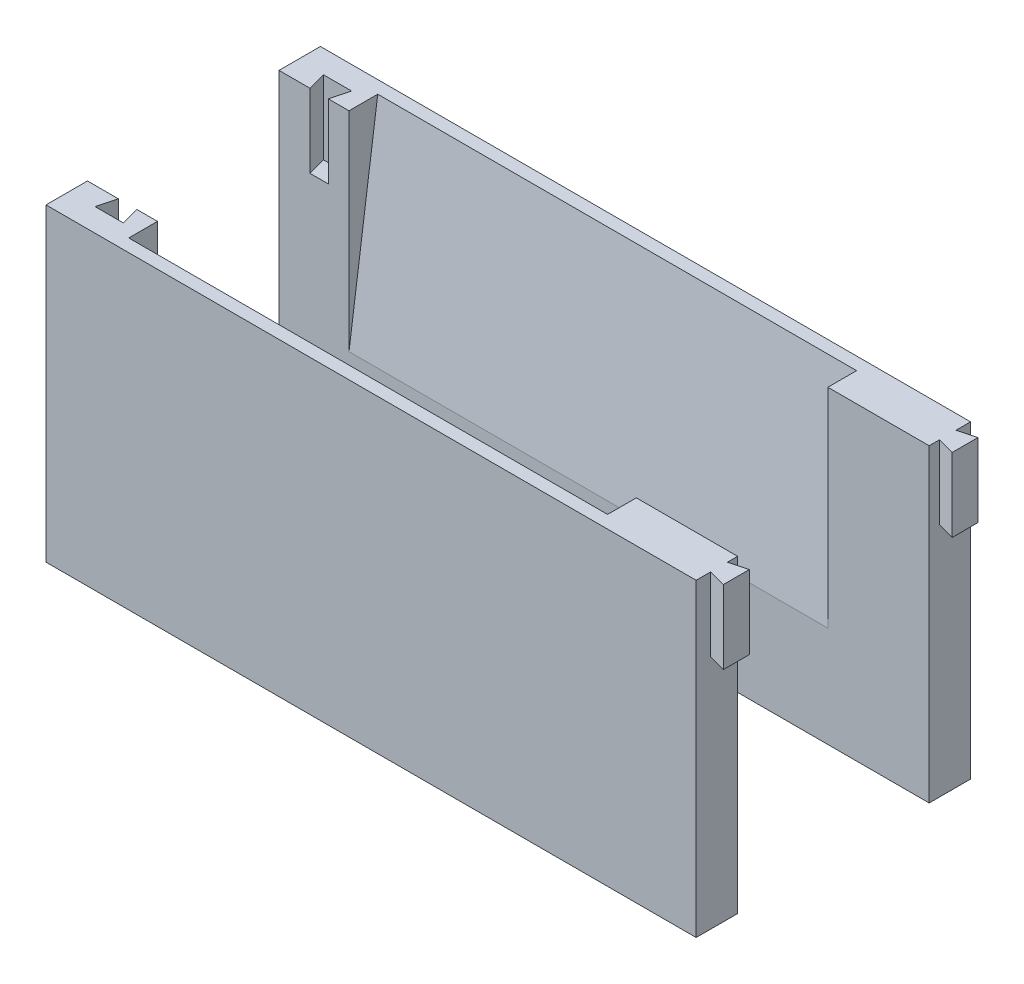
ISO-10303-21;
HEADER;
FILE_DESCRIPTION(('STEP AP214'),'2;1');
FILE_NAME('part.step','',(''),(''),'','','');
FILE_SCHEMA(('AUTOMOTIVE_DESIGN { 1 0 10303 214 1 1 1 1 }'));
ENDSEC;
DATA;
#1=APPLICATION_CONTEXT('core data for automotive mechanical design processes');
#2=APPLICATION_PROTOCOL_DEFINITION('international standard','automotive_design',2000,#1);
#3=PRODUCT_CONTEXT('',#1,'mechanical');
#4=PRODUCT('Part','Part','',(#3));
#5=PRODUCT_RELATED_PRODUCT_CATEGORY('part','',(#4));
#6=PRODUCT_DEFINITION_FORMATION('','',#4);
#7=PRODUCT_DEFINITION_CONTEXT('part definition',#1,'design');
#8=PRODUCT_DEFINITION('design','',#6,#7);
#9=PRODUCT_DEFINITION_SHAPE('','',#8);
#10=(LENGTH_UNIT() NAMED_UNIT(*) SI_UNIT(.MILLI.,.METRE.));
#11=(NAMED_UNIT(*) PLANE_ANGLE_UNIT() SI_UNIT($,.RADIAN.));
#12=(NAMED_UNIT(*) SI_UNIT($,.STERADIAN.) SOLID_ANGLE_UNIT());
#13=UNCERTAINTY_MEASURE_WITH_UNIT(LENGTH_MEASURE(1.E-05),#10,'distance_accuracy_value','');
#14=(GEOMETRIC_REPRESENTATION_CONTEXT(3) GLOBAL_UNCERTAINTY_ASSIGNED_CONTEXT((#13)) GLOBAL_UNIT_ASSIGNED_CONTEXT((#10,
#11,#12)) REPRESENTATION_CONTEXT('',''));
#15=CARTESIAN_POINT('',(0.,0.,0.));
#16=DIRECTION('',(0.,0.,1.));
#17=DIRECTION('',(1.,0.,0.));
#18=AXIS2_PLACEMENT_3D('',#15,#16,#17);
#19=CARTESIAN_POINT('',(46.2989745050857,14.0482922625164,-31.));
#20=DIRECTION('',(-1.,0.,0.));
#21=DIRECTION('',(0.,0.,-1.));
#22=AXIS2_PLACEMENT_3D('',#19,#20,#21);
#23=PLANE('',#22);
#24=DIRECTION('',(0.,1.,0.));
#25=VECTOR('',#24,1.);
#26=CARTESIAN_POINT('',(46.2989745050857,4.04829226251643,-27.4));
#27=LINE('',#26,#25);
#28=CARTESIAN_POINT('',(46.2989745050857,4.04829226251643,-27.4));
#29=VERTEX_POINT('',#28);
#30=CARTESIAN_POINT('',(46.2989745050857,14.0482922625164,-27.4));
#31=VERTEX_POINT('',#30);
#32=EDGE_CURVE('E225',#29,#31,#27,.T.);
#33=ORIENTED_EDGE('',*,*,#32,.T.);
#34=DIRECTION('',(0.,0.,1.));
#35=VECTOR('',#34,1.);
#36=CARTESIAN_POINT('',(46.2989745050857,14.0482922625164,-31.));
#37=LINE('',#36,#35);
#38=CARTESIAN_POINT('',(46.2989745050857,14.0482922625164,-26.));
#39=VERTEX_POINT('',#38);
#40=EDGE_CURVE('E170',#31,#39,#37,.T.);
#41=ORIENTED_EDGE('',*,*,#40,.T.);
#42=DIRECTION('',(0.,1.,0.));
#43=VECTOR('',#42,1.);
#44=CARTESIAN_POINT('',(46.2989745050857,14.0482922625164,-26.));
#45=LINE('',#44,#43);
#46=CARTESIAN_POINT('',(46.2989745050857,-27.9517077374836,-26.));
#47=VERTEX_POINT('',#46);
#48=EDGE_CURVE('E267',#47,#39,#45,.T.);
#49=ORIENTED_EDGE('',*,*,#48,.F.);
#50=DIRECTION('',(0.,0.,1.));
#51=VECTOR('',#50,1.);
#52=CARTESIAN_POINT('',(46.2989745050857,-27.9517077374836,-31.));
#53=LINE('',#52,#51);
#54=CARTESIAN_POINT('',(46.2989745050857,-27.9517077374836,-31.6203193977869));
#55=VERTEX_POINT('',#54);
#56=EDGE_CURVE('E61',#55,#47,#53,.T.);
#57=ORIENTED_EDGE('',*,*,#56,.F.);
#58=DIRECTION('',(0.,1.,0.));
#59=VECTOR('',#58,1.);
#60=CARTESIAN_POINT('',(46.2989745050857,-27.9517077374836,-31.6203193977869));
#61=LINE('',#60,#59);
#62=CARTESIAN_POINT('',(46.2989745050857,14.0482922625164,-31.6203193977869));
#63=VERTEX_POINT('',#62);
#64=EDGE_CURVE('E180',#55,#63,#61,.T.);
#65=ORIENTED_EDGE('',*,*,#64,.T.);
#66=CARTESIAN_POINT('',(46.2989745050857,14.0482922625164,-29.65));
#67=VERTEX_POINT('',#66);
#68=EDGE_CURVE('E184',#63,#67,#37,.T.);
#69=ORIENTED_EDGE('',*,*,#68,.T.);
#70=DIRECTION('',(0.,1.,0.));
#71=VECTOR('',#70,1.);
#72=CARTESIAN_POINT('',(46.2989745050857,4.04829226251643,-29.65));
#73=LINE('',#72,#71);
#74=CARTESIAN_POINT('',(46.2989745050857,4.04829226251643,-29.65));
#75=VERTEX_POINT('',#74);
#76=EDGE_CURVE('E219',#75,#67,#73,.T.);
#77=ORIENTED_EDGE('',*,*,#76,.F.);
#78=DIRECTION('',(0.,0.,-1.));
#79=VECTOR('',#78,1.);
#80=CARTESIAN_POINT('',(46.2989745050857,4.04829226251643,-27.4));
#81=LINE('',#80,#79);
#82=EDGE_CURVE('E209',#29,#75,#81,.T.);
#83=ORIENTED_EDGE('',*,*,#82,.F.);
#84=EDGE_LOOP('',(#33,#41,#49,#57,#65,#69,#77,#83));
#85=FACE_BOUND('',#84,.T.);
#86=ADVANCED_FACE('F53',(#85),#23,.F.);
#87=CARTESIAN_POINT('',(0.,0.,-26.));
#88=DIRECTION('',(0.,0.,-1.));
#89=DIRECTION('',(1.,0.,0.));
#90=AXIS2_PLACEMENT_3D('',#87,#88,#89);
#91=PLANE('',#90);
#92=DIRECTION('',(1.,0.,0.));
#93=VECTOR('',#92,1.);
#94=CARTESIAN_POINT('',(0.,-14.2665496728761,-26.));
#95=LINE('',#94,#93);
#96=CARTESIAN_POINT('',(-32.4510254949143,-14.2665496728761,-26.));
#97=VERTEX_POINT('',#96);
#98=CARTESIAN_POINT('',(32.5489745050857,-14.2665496728761,-26.));
#99=VERTEX_POINT('',#98);
#100=EDGE_CURVE('E206',#97,#99,#95,.T.);
#101=ORIENTED_EDGE('',*,*,#100,.F.);
#102=DIRECTION('',(0.,1.,0.));
#103=VECTOR('',#102,1.);
#104=CARTESIAN_POINT('',(-32.4510254949143,0.,-26.));
#105=LINE('',#104,#103);
#106=CARTESIAN_POINT('',(-32.4510254949143,14.0482922625164,-26.));
#107=VERTEX_POINT('',#106);
#108=EDGE_CURVE('E200',#97,#107,#105,.T.);
#109=ORIENTED_EDGE('',*,*,#108,.T.);
#110=DIRECTION('',(-1.,0.,0.));
#111=VECTOR('',#110,1.);
#112=CARTESIAN_POINT('',(-41.9510254949143,14.0482922625164,-26.));
#113=LINE('',#112,#111);
#114=CARTESIAN_POINT('',(-35.2510254949143,14.0482922625164,-26.));
#115=VERTEX_POINT('',#114);
#116=EDGE_CURVE('E272',#107,#115,#113,.T.);
#117=ORIENTED_EDGE('',*,*,#116,.T.);
#118=DIRECTION('',(0.,-1.,0.));
#119=VECTOR('',#118,1.);
#120=CARTESIAN_POINT('',(-35.2510254949143,188.876376348919,-26.));
#121=LINE('',#120,#119);
#122=CARTESIAN_POINT('',(-35.2510254949143,4.04829226251643,-26.));
#123=VERTEX_POINT('',#122);
#124=EDGE_CURVE('E256',#115,#123,#121,.T.);
#125=ORIENTED_EDGE('',*,*,#124,.T.);
#126=DIRECTION('',(-1.,0.,0.));
#127=VECTOR('',#126,1.);
#128=CARTESIAN_POINT('',(-41.9510254949143,4.04829226251643,-26.));
#129=LINE('',#128,#127);
#130=CARTESIAN_POINT('',(-37.7510254949143,4.04829226251643,-26.));
#131=VERTEX_POINT('',#130);
#132=EDGE_CURVE('E228',#123,#131,#129,.T.);
#133=ORIENTED_EDGE('',*,*,#132,.T.);
#134=DIRECTION('',(0.,-1.,0.));
#135=VECTOR('',#134,1.);
#136=CARTESIAN_POINT('',(-37.7510254949143,188.876376348919,-26.));
#137=LINE('',#136,#135);
#138=CARTESIAN_POINT('',(-37.7510254949143,14.0482922625164,-26.));
#139=VERTEX_POINT('',#138);
#140=EDGE_CURVE('E237',#139,#131,#137,.T.);
#141=ORIENTED_EDGE('',*,*,#140,.F.);
#142=CARTESIAN_POINT('',(-41.9510254949143,14.0482922625164,-26.));
#143=VERTEX_POINT('',#142);
#144=EDGE_CURVE('E270',#139,#143,#113,.T.);
#145=ORIENTED_EDGE('',*,*,#144,.T.);
#146=DIRECTION('',(0.,-1.,0.));
#147=VECTOR('',#146,1.);
#148=CARTESIAN_POINT('',(-41.9510254949143,14.0482922625164,-26.));
#149=LINE('',#148,#147);
#150=CARTESIAN_POINT('',(-41.9510254949143,-27.9517077374836,-26.));
#151=VERTEX_POINT('',#150);
#152=EDGE_CURVE('E166',#143,#151,#149,.T.);
#153=ORIENTED_EDGE('',*,*,#152,.T.);
#154=DIRECTION('',(1.,0.,0.));
#155=VECTOR('',#154,1.);
#156=CARTESIAN_POINT('',(-41.9510254949143,-27.9517077374836,-26.));
#157=LINE('',#156,#155);
#158=EDGE_CURVE('E265',#151,#47,#157,.T.);
#159=ORIENTED_EDGE('',*,*,#158,.T.);
#160=ORIENTED_EDGE('',*,*,#48,.T.);
#161=CARTESIAN_POINT('',(32.5489745050857,14.0482922625164,-26.));
#162=VERTEX_POINT('',#161);
#163=EDGE_CURVE('E171',#39,#162,#113,.T.);
#164=ORIENTED_EDGE('',*,*,#163,.T.);
#165=DIRECTION('',(0.,1.,0.));
#166=VECTOR('',#165,1.);
#167=CARTESIAN_POINT('',(32.5489745050857,0.,-26.));
#168=LINE('',#167,#166);
#169=EDGE_CURVE('E203',#99,#162,#168,.T.);
#170=ORIENTED_EDGE('',*,*,#169,.F.);
#171=EDGE_LOOP('',(#101,#109,#117,#125,#133,#141,#145,#153,#159,#160,#164,#170));
#172=FACE_BOUND('',#171,.T.);
#173=ADVANCED_FACE('F284',(#172),#91,.F.);
#174=CARTESIAN_POINT('',(-41.9510254949143,14.0482922625164,-31.));
#175=DIRECTION('',(1.,0.,0.));
#176=DIRECTION('',(0.,0.,1.));
#177=AXIS2_PLACEMENT_3D('',#174,#175,#176);
#178=PLANE('',#177);
#179=ORIENTED_EDGE('',*,*,#152,.F.);
#180=DIRECTION('',(0.,0.,1.));
#181=VECTOR('',#180,1.);
#182=CARTESIAN_POINT('',(-41.9510254949143,14.0482922625164,-31.));
#183=LINE('',#182,#181);
#184=CARTESIAN_POINT('',(-41.9510254949143,14.0482922625164,-31.6203193977869));
#185=VERTEX_POINT('',#184);
#186=EDGE_CURVE('E161',#185,#143,#183,.T.);
#187=ORIENTED_EDGE('',*,*,#186,.F.);
#188=DIRECTION('',(0.,1.,0.));
#189=VECTOR('',#188,1.);
#190=CARTESIAN_POINT('',(-41.9510254949143,-27.9517077374836,-31.6203193977869));
#191=LINE('',#190,#189);
#192=CARTESIAN_POINT('',(-41.9510254949143,-27.9517077374836,-31.6203193977869));
#193=VERTEX_POINT('',#192);
#194=EDGE_CURVE('E163',#193,#185,#191,.T.);
#195=ORIENTED_EDGE('',*,*,#194,.F.);
#196=DIRECTION('',(0.,0.,1.));
#197=VECTOR('',#196,1.);
#198=CARTESIAN_POINT('',(-41.9510254949143,-27.9517077374836,-31.));
#199=LINE('',#198,#197);
#200=EDGE_CURVE('E12',#193,#151,#199,.T.);
#201=ORIENTED_EDGE('',*,*,#200,.T.);
#202=EDGE_LOOP('',(#179,#187,#195,#201));
#203=FACE_BOUND('',#202,.T.);
#204=ADVANCED_FACE('F55',(#203),#178,.F.);
#205=CARTESIAN_POINT('',(-41.9510254949143,-27.9517077374836,-31.));
#206=DIRECTION('',(0.,1.,0.));
#207=DIRECTION('',(0.,0.,-1.));
#208=AXIS2_PLACEMENT_3D('',#205,#206,#207);
#209=PLANE('',#208);
#210=ORIENTED_EDGE('',*,*,#158,.F.);
#211=ORIENTED_EDGE('',*,*,#200,.F.);
#212=DIRECTION('',(-1.,0.,0.));
#213=VECTOR('',#212,1.);
#214=CARTESIAN_POINT('',(-41.9510254949143,-27.9517077374836,-31.6203193977869));
#215=LINE('',#214,#213);
#216=EDGE_CURVE('E179',#55,#193,#215,.T.);
#217=ORIENTED_EDGE('',*,*,#216,.F.);
#218=ORIENTED_EDGE('',*,*,#56,.T.);
#219=EDGE_LOOP('',(#210,#211,#217,#218));
#220=FACE_BOUND('',#219,.T.);
#221=ADVANCED_FACE('F278',(#220),#209,.F.);
#222=CARTESIAN_POINT('',(-41.9510254949143,14.0482922625164,-31.));
#223=DIRECTION('',(0.,-1.,0.));
#224=DIRECTION('',(0.,0.,1.));
#225=AXIS2_PLACEMENT_3D('',#222,#223,#224);
#226=PLANE('',#225);
#227=ORIENTED_EDGE('',*,*,#163,.F.);
#228=ORIENTED_EDGE('',*,*,#40,.F.);
#229=DIRECTION('',(-0.965925826289067,0.,-0.258819045102525));
#230=VECTOR('',#229,1.);
#231=CARTESIAN_POINT('',(48.6489745050857,14.0482922625164,-26.7703193977868));
#232=LINE('',#231,#230);
#233=CARTESIAN_POINT('',(48.6489745050857,14.0482922625164,-26.7703193977868));
#234=VERTEX_POINT('',#233);
#235=EDGE_CURVE('E213',#234,#31,#232,.T.);
#236=ORIENTED_EDGE('',*,*,#235,.F.);
#237=DIRECTION('',(0.,0.,1.));
#238=VECTOR('',#237,1.);
#239=CARTESIAN_POINT('',(48.6489745050857,14.0482922625164,-30.2796806022131));
#240=LINE('',#239,#238);
#241=CARTESIAN_POINT('',(48.6489745050857,14.0482922625164,-30.2796806022131));
#242=VERTEX_POINT('',#241);
#243=EDGE_CURVE('E221',#242,#234,#240,.T.);
#244=ORIENTED_EDGE('',*,*,#243,.F.);
#245=DIRECTION('',(0.965925826289067,0.,-0.258819045102525));
#246=VECTOR('',#245,1.);
#247=CARTESIAN_POINT('',(46.2989745050857,14.0482922625164,-29.65));
#248=LINE('',#247,#246);
#249=EDGE_CURVE('E76',#67,#242,#248,.T.);
#250=ORIENTED_EDGE('',*,*,#249,.F.);
#251=ORIENTED_EDGE('',*,*,#68,.F.);
#252=DIRECTION('',(-1.,0.,0.));
#253=VECTOR('',#252,1.);
#254=CARTESIAN_POINT('',(-41.9510254949143,14.0482922625164,-31.6203193977869));
#255=LINE('',#254,#253);
#256=EDGE_CURVE('E177',#63,#185,#255,.T.);
#257=ORIENTED_EDGE('',*,*,#256,.T.);
#258=ORIENTED_EDGE('',*,*,#186,.T.);
#259=ORIENTED_EDGE('',*,*,#144,.F.);
#260=DIRECTION('',(0.258819045102517,0.,0.965925826289069));
#261=VECTOR('',#260,1.);
#262=CARTESIAN_POINT('',(-37.7510254949143,14.0482922625164,-26.));
#263=LINE('',#262,#261);
#264=CARTESIAN_POINT('',(-38.4208984759921,14.0482922625164,-28.5));
#265=VERTEX_POINT('',#264);
#266=EDGE_CURVE('E241',#265,#139,#263,.T.);
#267=ORIENTED_EDGE('',*,*,#266,.F.);
#268=DIRECTION('',(-1.,0.,0.));
#269=VECTOR('',#268,1.);
#270=CARTESIAN_POINT('',(-38.4208984759921,14.0482922625164,-28.5));
#271=LINE('',#270,#269);
#272=CARTESIAN_POINT('',(-34.5811525138365,14.0482922625164,-28.5));
#273=VERTEX_POINT('',#272);
#274=EDGE_CURVE('E247',#273,#265,#271,.T.);
#275=ORIENTED_EDGE('',*,*,#274,.F.);
#276=DIRECTION('',(0.258819045102517,0.,-0.965925826289069));
#277=VECTOR('',#276,1.);
#278=CARTESIAN_POINT('',(-34.5811525138365,14.0482922625164,-28.5));
#279=LINE('',#278,#277);
#280=EDGE_CURVE('E244',#115,#273,#279,.T.);
#281=ORIENTED_EDGE('',*,*,#280,.F.);
#282=ORIENTED_EDGE('',*,*,#116,.F.);
#283=DIRECTION('',(0.,0.,1.));
#284=VECTOR('',#283,1.);
#285=CARTESIAN_POINT('',(-32.4510254949143,14.0482922625164,-26.));
#286=LINE('',#285,#284);
#287=CARTESIAN_POINT('',(-32.4510254949143,14.0482922625164,-29.9));
#288=VERTEX_POINT('',#287);
#289=EDGE_CURVE('E68',#288,#107,#286,.T.);
#290=ORIENTED_EDGE('',*,*,#289,.F.);
#291=DIRECTION('',(-1.,0.,0.));
#292=VECTOR('',#291,1.);
#293=CARTESIAN_POINT('',(32.5489745050857,14.0482922625164,-29.9));
#294=LINE('',#293,#292);
#295=CARTESIAN_POINT('',(32.5489745050857,14.0482922625164,-29.9));
#296=VERTEX_POINT('',#295);
#297=EDGE_CURVE('E195',#296,#288,#294,.T.);
#298=ORIENTED_EDGE('',*,*,#297,.F.);
#299=DIRECTION('',(0.,0.,1.));
#300=VECTOR('',#299,1.);
#301=CARTESIAN_POINT('',(32.5489745050857,14.0482922625164,-26.));
#302=LINE('',#301,#300);
#303=EDGE_CURVE('E194',#296,#162,#302,.T.);
#304=ORIENTED_EDGE('',*,*,#303,.T.);
#305=EDGE_LOOP('',(#227,#228,#236,#244,#250,#251,#257,#258,#259,#267,#275,#281,#282,#290,#298,#304));
#306=FACE_BOUND('',#305,.T.);
#307=ADVANCED_FACE('F182',(#306),#226,.F.);
#308=CARTESIAN_POINT('',(-34.5811525138365,188.876376348919,-28.5));
#309=DIRECTION('',(-0.965925826289069,0.,-0.258819045102517));
#310=DIRECTION('',(0.258819045102517,0.,-0.965925826289069));
#311=AXIS2_PLACEMENT_3D('',#308,#309,#310);
#312=PLANE('',#311);
#313=ORIENTED_EDGE('',*,*,#280,.T.);
#314=DIRECTION('',(0.,-1.,0.));
#315=VECTOR('',#314,1.);
#316=CARTESIAN_POINT('',(-34.5811525138365,188.876376348919,-28.5));
#317=LINE('',#316,#315);
#318=CARTESIAN_POINT('',(-34.5811525138365,4.04829226251643,-28.5));
#319=VERTEX_POINT('',#318);
#320=EDGE_CURVE('E259',#273,#319,#317,.T.);
#321=ORIENTED_EDGE('',*,*,#320,.T.);
#322=DIRECTION('',(0.258819045102517,0.,-0.965925826289069));
#323=VECTOR('',#322,1.);
#324=CARTESIAN_POINT('',(-34.5811525138365,4.04829226251643,-28.5));
#325=LINE('',#324,#323);
#326=EDGE_CURVE('E234',#123,#319,#325,.T.);
#327=ORIENTED_EDGE('',*,*,#326,.F.);
#328=ORIENTED_EDGE('',*,*,#124,.F.);
#329=EDGE_LOOP('',(#313,#321,#327,#328));
#330=FACE_BOUND('',#329,.T.);
#331=ADVANCED_FACE('F293',(#330),#312,.T.);
#332=CARTESIAN_POINT('',(-38.4208984759921,188.876376348919,-28.5));
#333=DIRECTION('',(0.,0.,1.));
#334=DIRECTION('',(-1.,0.,0.));
#335=AXIS2_PLACEMENT_3D('',#332,#333,#334);
#336=PLANE('',#335);
#337=ORIENTED_EDGE('',*,*,#274,.T.);
#338=DIRECTION('',(0.,-1.,0.));
#339=VECTOR('',#338,1.);
#340=CARTESIAN_POINT('',(-38.4208984759921,188.876376348919,-28.5));
#341=LINE('',#340,#339);
#342=CARTESIAN_POINT('',(-38.4208984759921,4.04829226251643,-28.5));
#343=VERTEX_POINT('',#342);
#344=EDGE_CURVE('E253',#265,#343,#341,.T.);
#345=ORIENTED_EDGE('',*,*,#344,.T.);
#346=DIRECTION('',(-1.,0.,0.));
#347=VECTOR('',#346,1.);
#348=CARTESIAN_POINT('',(-38.4208984759921,4.04829226251643,-28.5));
#349=LINE('',#348,#347);
#350=EDGE_CURVE('E238',#319,#343,#349,.T.);
#351=ORIENTED_EDGE('',*,*,#350,.F.);
#352=ORIENTED_EDGE('',*,*,#320,.F.);
#353=EDGE_LOOP('',(#337,#345,#351,#352));
#354=FACE_BOUND('',#353,.T.);
#355=ADVANCED_FACE('F300',(#354),#336,.T.);
#356=CARTESIAN_POINT('',(-37.7510254949143,188.876376348919,-26.));
#357=DIRECTION('',(0.965925826289069,0.,-0.258819045102517));
#358=DIRECTION('',(0.258819045102517,0.,0.965925826289069));
#359=AXIS2_PLACEMENT_3D('',#356,#357,#358);
#360=PLANE('',#359);
#361=ORIENTED_EDGE('',*,*,#266,.T.);
#362=ORIENTED_EDGE('',*,*,#140,.T.);
#363=DIRECTION('',(0.258819045102517,0.,0.965925826289069));
#364=VECTOR('',#363,1.);
#365=CARTESIAN_POINT('',(-37.7510254949143,4.04829226251643,-26.));
#366=LINE('',#365,#364);
#367=EDGE_CURVE('E239',#343,#131,#366,.T.);
#368=ORIENTED_EDGE('',*,*,#367,.F.);
#369=ORIENTED_EDGE('',*,*,#344,.F.);
#370=EDGE_LOOP('',(#361,#362,#368,#369));
#371=FACE_BOUND('',#370,.T.);
#372=ADVANCED_FACE('F298',(#371),#360,.T.);
#373=CARTESIAN_POINT('',(-41.9510254949143,4.04829226251643,-31.));
#374=DIRECTION('',(0.,-1.,0.));
#375=DIRECTION('',(0.,0.,1.));
#376=AXIS2_PLACEMENT_3D('',#373,#374,#375);
#377=PLANE('',#376);
#378=ORIENTED_EDGE('',*,*,#132,.F.);
#379=ORIENTED_EDGE('',*,*,#326,.T.);
#380=ORIENTED_EDGE('',*,*,#350,.T.);
#381=ORIENTED_EDGE('',*,*,#367,.T.);
#382=EDGE_LOOP('',(#378,#379,#380,#381));
#383=FACE_BOUND('',#382,.T.);
#384=ADVANCED_FACE('F296',(#383),#377,.F.);
#385=CARTESIAN_POINT('',(48.6489745050857,4.04829226251643,-26.7703193977868));
#386=DIRECTION('',(-0.258819045102525,0.,0.965925826289067));
#387=DIRECTION('',(-0.965925826289067,0.,-0.258819045102525));
#388=AXIS2_PLACEMENT_3D('',#385,#386,#387);
#389=PLANE('',#388);
#390=ORIENTED_EDGE('',*,*,#235,.T.);
#391=ORIENTED_EDGE('',*,*,#32,.F.);
#392=DIRECTION('',(-0.965925826289067,0.,-0.258819045102525));
#393=VECTOR('',#392,1.);
#394=CARTESIAN_POINT('',(48.6489745050857,4.04829226251643,-26.7703193977868));
#395=LINE('',#394,#393);
#396=CARTESIAN_POINT('',(48.6489745050857,4.04829226251643,-26.7703193977868));
#397=VERTEX_POINT('',#396);
#398=EDGE_CURVE('E217',#397,#29,#395,.T.);
#399=ORIENTED_EDGE('',*,*,#398,.F.);
#400=DIRECTION('',(0.,1.,0.));
#401=VECTOR('',#400,1.);
#402=CARTESIAN_POINT('',(48.6489745050857,4.04829226251643,-26.7703193977868));
#403=LINE('',#402,#401);
#404=EDGE_CURVE('E229',#397,#234,#403,.T.);
#405=ORIENTED_EDGE('',*,*,#404,.T.);
#406=EDGE_LOOP('',(#390,#391,#399,#405));
#407=FACE_BOUND('',#406,.T.);
#408=ADVANCED_FACE('F359',(#407),#389,.T.);
#409=CARTESIAN_POINT('',(48.6489745050857,4.04829226251643,-30.2796806022131));
#410=DIRECTION('',(1.,0.,0.));
#411=DIRECTION('',(0.,0.,1.));
#412=AXIS2_PLACEMENT_3D('',#409,#410,#411);
#413=PLANE('',#412);
#414=ORIENTED_EDGE('',*,*,#243,.T.);
#415=ORIENTED_EDGE('',*,*,#404,.F.);
#416=DIRECTION('',(0.,0.,1.));
#417=VECTOR('',#416,1.);
#418=CARTESIAN_POINT('',(48.6489745050857,4.04829226251643,-30.2796806022131));
#419=LINE('',#418,#417);
#420=CARTESIAN_POINT('',(48.6489745050857,4.04829226251643,-30.2796806022131));
#421=VERTEX_POINT('',#420);
#422=EDGE_CURVE('E215',#421,#397,#419,.T.);
#423=ORIENTED_EDGE('',*,*,#422,.F.);
#424=DIRECTION('',(0.,1.,0.));
#425=VECTOR('',#424,1.);
#426=CARTESIAN_POINT('',(48.6489745050857,4.04829226251643,-30.2796806022131));
#427=LINE('',#426,#425);
#428=EDGE_CURVE('E231',#421,#242,#427,.T.);
#429=ORIENTED_EDGE('',*,*,#428,.T.);
#430=EDGE_LOOP('',(#414,#415,#423,#429));
#431=FACE_BOUND('',#430,.T.);
#432=ADVANCED_FACE('F369',(#431),#413,.T.);
#433=CARTESIAN_POINT('',(46.2989745050857,4.04829226251643,-29.65));
#434=DIRECTION('',(-0.258819045102525,0.,-0.965925826289067));
#435=DIRECTION('',(0.965925826289067,0.,-0.258819045102525));
#436=AXIS2_PLACEMENT_3D('',#433,#434,#435);
#437=PLANE('',#436);
#438=ORIENTED_EDGE('',*,*,#249,.T.);
#439=ORIENTED_EDGE('',*,*,#428,.F.);
#440=DIRECTION('',(0.965925826289067,0.,-0.258819045102525));
#441=VECTOR('',#440,1.);
#442=CARTESIAN_POINT('',(46.2989745050857,4.04829226251643,-29.65));
#443=LINE('',#442,#441);
#444=EDGE_CURVE('E212',#75,#421,#443,.T.);
#445=ORIENTED_EDGE('',*,*,#444,.F.);
#446=ORIENTED_EDGE('',*,*,#76,.T.);
#447=EDGE_LOOP('',(#438,#439,#445,#446));
#448=FACE_BOUND('',#447,.T.);
#449=ADVANCED_FACE('F380',(#448),#437,.T.);
#450=CARTESIAN_POINT('',(0.,4.04829226251643,-26.));
#451=DIRECTION('',(0.,1.,0.));
#452=DIRECTION('',(0.,0.,-1.));
#453=AXIS2_PLACEMENT_3D('',#450,#451,#452);
#454=PLANE('',#453);
#455=ORIENTED_EDGE('',*,*,#82,.T.);
#456=ORIENTED_EDGE('',*,*,#444,.T.);
#457=ORIENTED_EDGE('',*,*,#422,.T.);
#458=ORIENTED_EDGE('',*,*,#398,.T.);
#459=EDGE_LOOP('',(#455,#456,#457,#458));
#460=FACE_BOUND('',#459,.T.);
#461=ADVANCED_FACE('F391',(#460),#454,.F.);
#462=CARTESIAN_POINT('',(32.5489745050857,-14.6295604669197,-25.95));
#463=DIRECTION('',(0.,-0.136448716147365,-0.990647135897407));
#464=DIRECTION('',(0.,-0.990647135897407,0.136448716147365));
#465=AXIS2_PLACEMENT_3D('',#462,#463,#464);
#466=PLANE('',#465);
#467=DIRECTION('',(0.,0.990647135897407,-0.136448716147365));
#468=VECTOR('',#467,1.);
#469=CARTESIAN_POINT('',(-32.4510254949143,-14.6295604669197,-25.95));
#470=LINE('',#469,#468);
#471=EDGE_CURVE('E186',#97,#288,#470,.T.);
#472=ORIENTED_EDGE('',*,*,#471,.F.);
#473=ORIENTED_EDGE('',*,*,#100,.T.);
#474=DIRECTION('',(0.,0.990647135897407,-0.136448716147365));
#475=VECTOR('',#474,1.);
#476=CARTESIAN_POINT('',(32.5489745050857,-14.6295604669197,-25.95));
#477=LINE('',#476,#475);
#478=EDGE_CURVE('E192',#99,#296,#477,.T.);
#479=ORIENTED_EDGE('',*,*,#478,.T.);
#480=ORIENTED_EDGE('',*,*,#297,.T.);
#481=EDGE_LOOP('',(#472,#473,#479,#480));
#482=FACE_BOUND('',#481,.T.);
#483=ADVANCED_FACE('F402',(#482),#466,.F.);
#484=CARTESIAN_POINT('',(32.5489745050857,0.,-26.));
#485=DIRECTION('',(1.,0.,0.));
#486=DIRECTION('',(0.,0.,1.));
#487=AXIS2_PLACEMENT_3D('',#484,#485,#486);
#488=PLANE('',#487);
#489=ORIENTED_EDGE('',*,*,#478,.F.);
#490=ORIENTED_EDGE('',*,*,#169,.T.);
#491=ORIENTED_EDGE('',*,*,#303,.F.);
#492=EDGE_LOOP('',(#489,#490,#491));
#493=FACE_BOUND('',#492,.T.);
#494=ADVANCED_FACE('F413',(#493),#488,.F.);
#495=CARTESIAN_POINT('',(-32.4510254949143,0.,-26.));
#496=DIRECTION('',(1.,0.,0.));
#497=DIRECTION('',(0.,0.,1.));
#498=AXIS2_PLACEMENT_3D('',#495,#496,#497);
#499=PLANE('',#498);
#500=ORIENTED_EDGE('',*,*,#108,.F.);
#501=ORIENTED_EDGE('',*,*,#471,.T.);
#502=ORIENTED_EDGE('',*,*,#289,.T.);
#503=EDGE_LOOP('',(#500,#501,#502));
#504=FACE_BOUND('',#503,.T.);
#505=ADVANCED_FACE('F424',(#504),#499,.T.);
#506=CARTESIAN_POINT('',(-41.9510254949143,-27.9517077374836,-31.6203193977869));
#507=DIRECTION('',(0.,0.,-1.));
#508=DIRECTION('',(-1.,0.,0.));
#509=AXIS2_PLACEMENT_3D('',#506,#507,#508);
#510=PLANE('',#509);
#511=ORIENTED_EDGE('',*,*,#256,.F.);
#512=ORIENTED_EDGE('',*,*,#64,.F.);
#513=ORIENTED_EDGE('',*,*,#216,.T.);
#514=ORIENTED_EDGE('',*,*,#194,.T.);
#515=EDGE_LOOP('',(#511,#512,#513,#514));
#516=FACE_BOUND('',#515,.T.);
#517=ADVANCED_FACE('F175',(#516),#510,.T.);
#518=CLOSED_SHELL('',(#86,#173,#204,#221,#307,#331,#355,#372,#384,#408,#432,#449,#461,#483,#494,
#505,#517));
#519=MANIFOLD_SOLID_BREP('B2',#518);
#520=CARTESIAN_POINT('',(46.2989745050857,14.0482922625164,5.));
#521=DIRECTION('',(-1.,0.,0.));
#522=DIRECTION('',(0.,0.,1.));
#523=AXIS2_PLACEMENT_3D('',#520,#521,#522);
#524=PLANE('',#523);
#525=DIRECTION('',(0.,1.,0.));
#526=VECTOR('',#525,1.);
#527=CARTESIAN_POINT('',(46.2989745050857,4.04829226251643,1.4));
#528=LINE('',#527,#526);
#529=CARTESIAN_POINT('',(46.2989745050857,4.04829226251643,1.4));
#530=VERTEX_POINT('',#529);
#531=CARTESIAN_POINT('',(46.2989745050857,14.0482922625164,1.4));
#532=VERTEX_POINT('',#531);
#533=EDGE_CURVE('E680',#530,#532,#528,.T.);
#534=ORIENTED_EDGE('',*,*,#533,.F.);
#535=DIRECTION('',(0.,0.,1.));
#536=VECTOR('',#535,1.);
#537=CARTESIAN_POINT('',(46.2989745050857,4.04829226251643,1.4));
#538=LINE('',#537,#536);
#539=CARTESIAN_POINT('',(46.2989745050857,4.04829226251643,3.65));
#540=VERTEX_POINT('',#539);
#541=EDGE_CURVE('E660',#530,#540,#538,.T.);
#542=ORIENTED_EDGE('',*,*,#541,.T.);
#543=DIRECTION('',(0.,1.,0.));
#544=VECTOR('',#543,1.);
#545=CARTESIAN_POINT('',(46.2989745050857,4.04829226251643,3.65));
#546=LINE('',#545,#544);
#547=CARTESIAN_POINT('',(46.2989745050857,14.0482922625164,3.65));
#548=VERTEX_POINT('',#547);
#549=EDGE_CURVE('E673',#540,#548,#546,.T.);
#550=ORIENTED_EDGE('',*,*,#549,.T.);
#551=DIRECTION('',(0.,0.,-1.));
#552=VECTOR('',#551,1.);
#553=CARTESIAN_POINT('',(46.2989745050857,14.0482922625164,5.));
#554=LINE('',#553,#552);
#555=CARTESIAN_POINT('',(46.2989745050857,14.0482922625164,5.63));
#556=VERTEX_POINT('',#555);
#557=EDGE_CURVE('E732',#556,#548,#554,.T.);
#558=ORIENTED_EDGE('',*,*,#557,.F.);
#559=DIRECTION('',(0.,1.,0.));
#560=VECTOR('',#559,1.);
#561=CARTESIAN_POINT('',(46.2989745050857,-27.9517077374836,5.63));
#562=LINE('',#561,#560);
#563=CARTESIAN_POINT('',(46.2989745050857,-27.9517077374836,5.63));
#564=VERTEX_POINT('',#563);
#565=EDGE_CURVE('E633',#564,#556,#562,.T.);
#566=ORIENTED_EDGE('',*,*,#565,.F.);
#567=DIRECTION('',(0.,0.,-1.));
#568=VECTOR('',#567,1.);
#569=CARTESIAN_POINT('',(46.2989745050857,-27.9517077374836,5.));
#570=LINE('',#569,#568);
#571=CARTESIAN_POINT('',(46.2989745050857,-27.9517077374836,0.));
#572=VERTEX_POINT('',#571);
#573=EDGE_CURVE('E517',#564,#572,#570,.T.);
#574=ORIENTED_EDGE('',*,*,#573,.T.);
#575=DIRECTION('',(0.,1.,0.));
#576=VECTOR('',#575,1.);
#577=CARTESIAN_POINT('',(46.2989745050857,14.0482922625164,0.));
#578=LINE('',#577,#576);
#579=CARTESIAN_POINT('',(46.2989745050857,14.0482922625164,0.));
#580=VERTEX_POINT('',#579);
#581=EDGE_CURVE('E721',#572,#580,#578,.T.);
#582=ORIENTED_EDGE('',*,*,#581,.T.);
#583=EDGE_CURVE('E731',#532,#580,#554,.T.);
#584=ORIENTED_EDGE('',*,*,#583,.F.);
#585=EDGE_LOOP('',(#534,#542,#550,#558,#566,#574,#582,#584));
#586=FACE_BOUND('',#585,.T.);
#587=ADVANCED_FACE('F509',(#586),#524,.F.);
#588=CARTESIAN_POINT('',(0.,0.,0.));
#589=DIRECTION('',(0.,0.,1.));
#590=DIRECTION('',(1.,0.,0.));
#591=AXIS2_PLACEMENT_3D('',#588,#589,#590);
#592=PLANE('',#591);
#593=DIRECTION('',(1.,0.,0.));
#594=VECTOR('',#593,1.);
#595=CARTESIAN_POINT('',(0.,-14.2665496728761,0.));
#596=LINE('',#595,#594);
#597=CARTESIAN_POINT('',(-32.4510254949143,-14.2665496728761,0.));
#598=VERTEX_POINT('',#597);
#599=CARTESIAN_POINT('',(32.5489745050857,-14.2665496728761,0.));
#600=VERTEX_POINT('',#599);
#601=EDGE_CURVE('E657',#598,#600,#596,.T.);
#602=ORIENTED_EDGE('',*,*,#601,.T.);
#603=DIRECTION('',(0.,1.,0.));
#604=VECTOR('',#603,1.);
#605=CARTESIAN_POINT('',(32.5489745050857,0.,0.));
#606=LINE('',#605,#604);
#607=CARTESIAN_POINT('',(32.5489745050857,14.0482922625164,0.));
#608=VERTEX_POINT('',#607);
#609=EDGE_CURVE('E654',#600,#608,#606,.T.);
#610=ORIENTED_EDGE('',*,*,#609,.T.);
#611=DIRECTION('',(-1.,0.,0.));
#612=VECTOR('',#611,1.);
#613=CARTESIAN_POINT('',(-41.9510254949143,14.0482922625164,0.));
#614=LINE('',#613,#612);
#615=EDGE_CURVE('E725',#580,#608,#614,.T.);
#616=ORIENTED_EDGE('',*,*,#615,.F.);
#617=ORIENTED_EDGE('',*,*,#581,.F.);
#618=DIRECTION('',(1.,0.,0.));
#619=VECTOR('',#618,1.);
#620=CARTESIAN_POINT('',(-41.9510254949143,-27.9517077374836,0.));
#621=LINE('',#620,#619);
#622=CARTESIAN_POINT('',(-41.9510254949143,-27.9517077374836,0.));
#623=VERTEX_POINT('',#622);
#624=EDGE_CURVE('E719',#623,#572,#621,.T.);
#625=ORIENTED_EDGE('',*,*,#624,.F.);
#626=DIRECTION('',(0.,-1.,0.));
#627=VECTOR('',#626,1.);
#628=CARTESIAN_POINT('',(-41.9510254949143,14.0482922625164,0.));
#629=LINE('',#628,#627);
#630=CARTESIAN_POINT('',(-41.9510254949143,14.0482922625164,0.));
#631=VERTEX_POINT('',#630);
#632=EDGE_CURVE('E623',#631,#623,#629,.T.);
#633=ORIENTED_EDGE('',*,*,#632,.F.);
#634=CARTESIAN_POINT('',(-37.7510254949143,14.0482922625164,0.));
#635=VERTEX_POINT('',#634);
#636=EDGE_CURVE('E724',#635,#631,#614,.T.);
#637=ORIENTED_EDGE('',*,*,#636,.F.);
#638=DIRECTION('',(0.,-1.,0.));
#639=VECTOR('',#638,1.);
#640=CARTESIAN_POINT('',(-37.7510254949143,188.876376348919,0.));
#641=LINE('',#640,#639);
#642=CARTESIAN_POINT('',(-37.7510254949143,4.04829226251643,0.));
#643=VERTEX_POINT('',#642);
#644=EDGE_CURVE('E691',#635,#643,#641,.T.);
#645=ORIENTED_EDGE('',*,*,#644,.T.);
#646=DIRECTION('',(-1.,0.,0.));
#647=VECTOR('',#646,1.);
#648=CARTESIAN_POINT('',(-41.9510254949143,4.04829226251643,0.));
#649=LINE('',#648,#647);
#650=CARTESIAN_POINT('',(-35.2510254949143,4.04829226251643,0.));
#651=VERTEX_POINT('',#650);
#652=EDGE_CURVE('E682',#651,#643,#649,.T.);
#653=ORIENTED_EDGE('',*,*,#652,.F.);
#654=DIRECTION('',(0.,-1.,0.));
#655=VECTOR('',#654,1.);
#656=CARTESIAN_POINT('',(-35.2510254949143,188.876376348919,0.));
#657=LINE('',#656,#655);
#658=CARTESIAN_POINT('',(-35.2510254949143,14.0482922625164,0.));
#659=VERTEX_POINT('',#658);
#660=EDGE_CURVE('E712',#659,#651,#657,.T.);
#661=ORIENTED_EDGE('',*,*,#660,.F.);
#662=CARTESIAN_POINT('',(-32.4510254949143,14.0482922625164,0.));
#663=VERTEX_POINT('',#662);
#664=EDGE_CURVE('E729',#663,#659,#614,.T.);
#665=ORIENTED_EDGE('',*,*,#664,.F.);
#666=DIRECTION('',(0.,1.,0.));
#667=VECTOR('',#666,1.);
#668=CARTESIAN_POINT('',(-32.4510254949143,0.,0.));
#669=LINE('',#668,#667);
#670=EDGE_CURVE('E524',#598,#663,#669,.T.);
#671=ORIENTED_EDGE('',*,*,#670,.F.);
#672=EDGE_LOOP('',(#602,#610,#616,#617,#625,#633,#637,#645,#653,#661,#665,#671));
#673=FACE_BOUND('',#672,.T.);
#674=ADVANCED_FACE('F740',(#673),#592,.F.);
#675=CARTESIAN_POINT('',(-41.9510254949143,14.0482922625164,5.));
#676=DIRECTION('',(1.,0.,0.));
#677=DIRECTION('',(0.,0.,-1.));
#678=AXIS2_PLACEMENT_3D('',#675,#676,#677);
#679=PLANE('',#678);
#680=ORIENTED_EDGE('',*,*,#632,.T.);
#681=DIRECTION('',(0.,0.,-1.));
#682=VECTOR('',#681,1.);
#683=CARTESIAN_POINT('',(-41.9510254949143,-27.9517077374836,5.));
#684=LINE('',#683,#682);
#685=CARTESIAN_POINT('',(-41.9510254949143,-27.9517077374836,5.63));
#686=VERTEX_POINT('',#685);
#687=EDGE_CURVE('E51',#686,#623,#684,.T.);
#688=ORIENTED_EDGE('',*,*,#687,.F.);
#689=DIRECTION('',(0.,1.,0.));
#690=VECTOR('',#689,1.);
#691=CARTESIAN_POINT('',(-41.9510254949143,-27.9517077374836,5.63));
#692=LINE('',#691,#690);
#693=CARTESIAN_POINT('',(-41.9510254949143,14.0482922625164,5.63));
#694=VERTEX_POINT('',#693);
#695=EDGE_CURVE('E620',#686,#694,#692,.T.);
#696=ORIENTED_EDGE('',*,*,#695,.T.);
#697=DIRECTION('',(0.,0.,-1.));
#698=VECTOR('',#697,1.);
#699=CARTESIAN_POINT('',(-41.9510254949143,14.0482922625164,5.));
#700=LINE('',#699,#698);
#701=EDGE_CURVE('E728',#694,#631,#700,.T.);
#702=ORIENTED_EDGE('',*,*,#701,.T.);
#703=EDGE_LOOP('',(#680,#688,#696,#702));
#704=FACE_BOUND('',#703,.T.);
#705=ADVANCED_FACE('F511',(#704),#679,.F.);
#706=CARTESIAN_POINT('',(-41.9510254949143,-27.9517077374836,5.));
#707=DIRECTION('',(0.,1.,0.));
#708=DIRECTION('',(0.,0.,1.));
#709=AXIS2_PLACEMENT_3D('',#706,#707,#708);
#710=PLANE('',#709);
#711=ORIENTED_EDGE('',*,*,#624,.T.);
#712=ORIENTED_EDGE('',*,*,#573,.F.);
#713=DIRECTION('',(1.,0.,0.));
#714=VECTOR('',#713,1.);
#715=CARTESIAN_POINT('',(-41.9510254949143,-27.9517077374836,5.63));
#716=LINE('',#715,#714);
#717=EDGE_CURVE('E630',#686,#564,#716,.T.);
#718=ORIENTED_EDGE('',*,*,#717,.F.);
#719=ORIENTED_EDGE('',*,*,#687,.T.);
#720=EDGE_LOOP('',(#711,#712,#718,#719));
#721=FACE_BOUND('',#720,.T.);
#722=ADVANCED_FACE('F635',(#721),#710,.F.);
#723=CARTESIAN_POINT('',(-41.9510254949143,14.0482922625164,5.));
#724=DIRECTION('',(0.,-1.,0.));
#725=DIRECTION('',(0.,0.,-1.));
#726=AXIS2_PLACEMENT_3D('',#723,#724,#725);
#727=PLANE('',#726);
#728=ORIENTED_EDGE('',*,*,#615,.T.);
#729=DIRECTION('',(0.,0.,-1.));
#730=VECTOR('',#729,1.);
#731=CARTESIAN_POINT('',(32.5489745050857,14.0482922625164,0.));
#732=LINE('',#731,#730);
#733=CARTESIAN_POINT('',(32.5489745050857,14.0482922625164,3.9));
#734=VERTEX_POINT('',#733);
#735=EDGE_CURVE('E645',#734,#608,#732,.T.);
#736=ORIENTED_EDGE('',*,*,#735,.F.);
#737=DIRECTION('',(-1.,0.,0.));
#738=VECTOR('',#737,1.);
#739=CARTESIAN_POINT('',(32.5489745050857,14.0482922625164,3.9));
#740=LINE('',#739,#738);
#741=CARTESIAN_POINT('',(-32.4510254949143,14.0482922625164,3.9));
#742=VERTEX_POINT('',#741);
#743=EDGE_CURVE('E648',#734,#742,#740,.T.);
#744=ORIENTED_EDGE('',*,*,#743,.T.);
#745=DIRECTION('',(0.,0.,-1.));
#746=VECTOR('',#745,1.);
#747=CARTESIAN_POINT('',(-32.4510254949143,14.0482922625164,0.));
#748=LINE('',#747,#746);
#749=EDGE_CURVE('E646',#742,#663,#748,.T.);
#750=ORIENTED_EDGE('',*,*,#749,.T.);
#751=ORIENTED_EDGE('',*,*,#664,.T.);
#752=DIRECTION('',(0.258819045102517,0.,0.965925826289069));
#753=VECTOR('',#752,1.);
#754=CARTESIAN_POINT('',(-34.5811525138365,14.0482922625164,2.5));
#755=LINE('',#754,#753);
#756=CARTESIAN_POINT('',(-34.5811525138365,14.0482922625164,2.5));
#757=VERTEX_POINT('',#756);
#758=EDGE_CURVE('E699',#659,#757,#755,.T.);
#759=ORIENTED_EDGE('',*,*,#758,.T.);
#760=DIRECTION('',(-1.,0.,0.));
#761=VECTOR('',#760,1.);
#762=CARTESIAN_POINT('',(-38.4208984759921,14.0482922625164,2.5));
#763=LINE('',#762,#761);
#764=CARTESIAN_POINT('',(-38.4208984759921,14.0482922625164,2.5));
#765=VERTEX_POINT('',#764);
#766=EDGE_CURVE('E702',#757,#765,#763,.T.);
#767=ORIENTED_EDGE('',*,*,#766,.T.);
#768=DIRECTION('',(0.258819045102517,0.,-0.965925826289069));
#769=VECTOR('',#768,1.);
#770=CARTESIAN_POINT('',(-37.7510254949143,14.0482922625164,0.));
#771=LINE('',#770,#769);
#772=EDGE_CURVE('E696',#765,#635,#771,.T.);
#773=ORIENTED_EDGE('',*,*,#772,.T.);
#774=ORIENTED_EDGE('',*,*,#636,.T.);
#775=ORIENTED_EDGE('',*,*,#701,.F.);
#776=DIRECTION('',(1.,0.,0.));
#777=VECTOR('',#776,1.);
#778=CARTESIAN_POINT('',(-41.9510254949143,14.0482922625164,5.63));
#779=LINE('',#778,#777);
#780=EDGE_CURVE('E632',#694,#556,#779,.T.);
#781=ORIENTED_EDGE('',*,*,#780,.T.);
#782=ORIENTED_EDGE('',*,*,#557,.T.);
#783=DIRECTION('',(0.965925826289067,0.,0.258819045102525));
#784=VECTOR('',#783,1.);
#785=CARTESIAN_POINT('',(46.2989745050857,14.0482922625164,3.65));
#786=LINE('',#785,#784);
#787=CARTESIAN_POINT('',(48.6489745050857,14.0482922625164,4.27968060221315));
#788=VERTEX_POINT('',#787);
#789=EDGE_CURVE('E532',#548,#788,#786,.T.);
#790=ORIENTED_EDGE('',*,*,#789,.T.);
#791=DIRECTION('',(0.,0.,-1.));
#792=VECTOR('',#791,1.);
#793=CARTESIAN_POINT('',(48.6489745050857,14.0482922625164,4.27968060221315));
#794=LINE('',#793,#792);
#795=CARTESIAN_POINT('',(48.6489745050857,14.0482922625164,0.770319397786852));
#796=VERTEX_POINT('',#795);
#797=EDGE_CURVE('E675',#788,#796,#794,.T.);
#798=ORIENTED_EDGE('',*,*,#797,.T.);
#799=DIRECTION('',(-0.965925826289067,0.,0.258819045102525));
#800=VECTOR('',#799,1.);
#801=CARTESIAN_POINT('',(48.6489745050857,14.0482922625164,0.770319397786852));
#802=LINE('',#801,#800);
#803=EDGE_CURVE('E664',#796,#532,#802,.T.);
#804=ORIENTED_EDGE('',*,*,#803,.T.);
#805=ORIENTED_EDGE('',*,*,#583,.T.);
#806=EDGE_LOOP('',(#728,#736,#744,#750,#751,#759,#767,#773,#774,#775,#781,#782,#790,#798,#804,#805));
#807=FACE_BOUND('',#806,.T.);
#808=ADVANCED_FACE('F743',(#807),#727,.F.);
#809=CARTESIAN_POINT('',(-34.5811525138365,188.876376348919,2.5));
#810=DIRECTION('',(-0.965925826289069,0.,0.258819045102517));
#811=DIRECTION('',(0.258819045102517,0.,0.965925826289069));
#812=AXIS2_PLACEMENT_3D('',#809,#810,#811);
#813=PLANE('',#812);
#814=ORIENTED_EDGE('',*,*,#758,.F.);
#815=ORIENTED_EDGE('',*,*,#660,.T.);
#816=DIRECTION('',(0.258819045102517,0.,0.965925826289069));
#817=VECTOR('',#816,1.);
#818=CARTESIAN_POINT('',(-34.5811525138365,4.04829226251643,2.5));
#819=LINE('',#818,#817);
#820=CARTESIAN_POINT('',(-34.5811525138365,4.04829226251643,2.5));
#821=VERTEX_POINT('',#820);
#822=EDGE_CURVE('E688',#651,#821,#819,.T.);
#823=ORIENTED_EDGE('',*,*,#822,.T.);
#824=DIRECTION('',(0.,-1.,0.));
#825=VECTOR('',#824,1.);
#826=CARTESIAN_POINT('',(-34.5811525138365,188.876376348919,2.5));
#827=LINE('',#826,#825);
#828=EDGE_CURVE('E714',#757,#821,#827,.T.);
#829=ORIENTED_EDGE('',*,*,#828,.F.);
#830=EDGE_LOOP('',(#814,#815,#823,#829));
#831=FACE_BOUND('',#830,.T.);
#832=ADVANCED_FACE('F761',(#831),#813,.T.);
#833=CARTESIAN_POINT('',(-38.4208984759921,188.876376348919,2.5));
#834=DIRECTION('',(0.,0.,-1.));
#835=DIRECTION('',(-1.,0.,0.));
#836=AXIS2_PLACEMENT_3D('',#833,#834,#835);
#837=PLANE('',#836);
#838=ORIENTED_EDGE('',*,*,#766,.F.);
#839=ORIENTED_EDGE('',*,*,#828,.T.);
#840=DIRECTION('',(-1.,0.,0.));
#841=VECTOR('',#840,1.);
#842=CARTESIAN_POINT('',(-38.4208984759921,4.04829226251643,2.5));
#843=LINE('',#842,#841);
#844=CARTESIAN_POINT('',(-38.4208984759921,4.04829226251643,2.5));
#845=VERTEX_POINT('',#844);
#846=EDGE_CURVE('E692',#821,#845,#843,.T.);
#847=ORIENTED_EDGE('',*,*,#846,.T.);
#848=DIRECTION('',(0.,-1.,0.));
#849=VECTOR('',#848,1.);
#850=CARTESIAN_POINT('',(-38.4208984759921,188.876376348919,2.5));
#851=LINE('',#850,#849);
#852=EDGE_CURVE('E709',#765,#845,#851,.T.);
#853=ORIENTED_EDGE('',*,*,#852,.F.);
#854=EDGE_LOOP('',(#838,#839,#847,#853));
#855=FACE_BOUND('',#854,.T.);
#856=ADVANCED_FACE('F769',(#855),#837,.T.);
#857=CARTESIAN_POINT('',(-37.7510254949143,188.876376348919,0.));
#858=DIRECTION('',(0.965925826289069,0.,0.258819045102517));
#859=DIRECTION('',(0.258819045102517,0.,-0.965925826289069));
#860=AXIS2_PLACEMENT_3D('',#857,#858,#859);
#861=PLANE('',#860);
#862=ORIENTED_EDGE('',*,*,#772,.F.);
#863=ORIENTED_EDGE('',*,*,#852,.T.);
#864=DIRECTION('',(0.258819045102517,0.,-0.965925826289069));
#865=VECTOR('',#864,1.);
#866=CARTESIAN_POINT('',(-37.7510254949143,4.04829226251643,0.));
#867=LINE('',#866,#865);
#868=EDGE_CURVE('E693',#845,#643,#867,.T.);
#869=ORIENTED_EDGE('',*,*,#868,.T.);
#870=ORIENTED_EDGE('',*,*,#644,.F.);
#871=EDGE_LOOP('',(#862,#863,#869,#870));
#872=FACE_BOUND('',#871,.T.);
#873=ADVANCED_FACE('F766',(#872),#861,.T.);
#874=CARTESIAN_POINT('',(-41.9510254949143,4.04829226251643,5.));
#875=DIRECTION('',(0.,-1.,0.));
#876=DIRECTION('',(0.,0.,-1.));
#877=AXIS2_PLACEMENT_3D('',#874,#875,#876);
#878=PLANE('',#877);
#879=ORIENTED_EDGE('',*,*,#652,.T.);
#880=ORIENTED_EDGE('',*,*,#868,.F.);
#881=ORIENTED_EDGE('',*,*,#846,.F.);
#882=ORIENTED_EDGE('',*,*,#822,.F.);
#883=EDGE_LOOP('',(#879,#880,#881,#882));
#884=FACE_BOUND('',#883,.T.);
#885=ADVANCED_FACE('F764',(#884),#878,.F.);
#886=CARTESIAN_POINT('',(48.6489745050857,4.04829226251643,0.770319397786852));
#887=DIRECTION('',(-0.258819045102525,0.,-0.965925826289067));
#888=DIRECTION('',(-0.965925826289067,0.,0.258819045102525));
#889=AXIS2_PLACEMENT_3D('',#886,#887,#888);
#890=PLANE('',#889);
#891=ORIENTED_EDGE('',*,*,#803,.F.);
#892=DIRECTION('',(0.,1.,0.));
#893=VECTOR('',#892,1.);
#894=CARTESIAN_POINT('',(48.6489745050857,4.04829226251643,0.770319397786852));
#895=LINE('',#894,#893);
#896=CARTESIAN_POINT('',(48.6489745050857,4.04829226251643,0.770319397786852));
#897=VERTEX_POINT('',#896);
#898=EDGE_CURVE('E683',#897,#796,#895,.T.);
#899=ORIENTED_EDGE('',*,*,#898,.F.);
#900=DIRECTION('',(-0.965925826289067,0.,0.258819045102525));
#901=VECTOR('',#900,1.);
#902=CARTESIAN_POINT('',(48.6489745050857,4.04829226251643,0.770319397786852));
#903=LINE('',#902,#901);
#904=EDGE_CURVE('E670',#897,#530,#903,.T.);
#905=ORIENTED_EDGE('',*,*,#904,.T.);
#906=ORIENTED_EDGE('',*,*,#533,.T.);
#907=EDGE_LOOP('',(#891,#899,#905,#906));
#908=FACE_BOUND('',#907,.T.);
#909=ADVANCED_FACE('F746',(#908),#890,.T.);
#910=CARTESIAN_POINT('',(48.6489745050857,4.04829226251643,4.27968060221315));
#911=DIRECTION('',(1.,0.,0.));
#912=DIRECTION('',(0.,0.,-1.));
#913=AXIS2_PLACEMENT_3D('',#910,#911,#912);
#914=PLANE('',#913);
#915=ORIENTED_EDGE('',*,*,#797,.F.);
#916=DIRECTION('',(0.,1.,0.));
#917=VECTOR('',#916,1.);
#918=CARTESIAN_POINT('',(48.6489745050857,4.04829226251643,4.27968060221315));
#919=LINE('',#918,#917);
#920=CARTESIAN_POINT('',(48.6489745050857,4.04829226251643,4.27968060221315));
#921=VERTEX_POINT('',#920);
#922=EDGE_CURVE('E685',#921,#788,#919,.T.);
#923=ORIENTED_EDGE('',*,*,#922,.F.);
#924=DIRECTION('',(0.,0.,-1.));
#925=VECTOR('',#924,1.);
#926=CARTESIAN_POINT('',(48.6489745050857,4.04829226251643,4.27968060221315));
#927=LINE('',#926,#925);
#928=EDGE_CURVE('E667',#921,#897,#927,.T.);
#929=ORIENTED_EDGE('',*,*,#928,.T.);
#930=ORIENTED_EDGE('',*,*,#898,.T.);
#931=EDGE_LOOP('',(#915,#923,#929,#930));
#932=FACE_BOUND('',#931,.T.);
#933=ADVANCED_FACE('F895',(#932),#914,.T.);
#934=CARTESIAN_POINT('',(46.2989745050857,4.04829226251643,3.65));
#935=DIRECTION('',(-0.258819045102525,0.,0.965925826289067));
#936=DIRECTION('',(0.965925826289067,0.,0.258819045102525));
#937=AXIS2_PLACEMENT_3D('',#934,#935,#936);
#938=PLANE('',#937);
#939=ORIENTED_EDGE('',*,*,#789,.F.);
#940=ORIENTED_EDGE('',*,*,#549,.F.);
#941=DIRECTION('',(0.965925826289067,0.,0.258819045102525));
#942=VECTOR('',#941,1.);
#943=CARTESIAN_POINT('',(46.2989745050857,4.04829226251643,3.65));
#944=LINE('',#943,#942);
#945=EDGE_CURVE('E663',#540,#921,#944,.T.);
#946=ORIENTED_EDGE('',*,*,#945,.T.);
#947=ORIENTED_EDGE('',*,*,#922,.T.);
#948=EDGE_LOOP('',(#939,#940,#946,#947));
#949=FACE_BOUND('',#948,.T.);
#950=ADVANCED_FACE('F752',(#949),#938,.T.);
#951=CARTESIAN_POINT('',(0.,4.04829226251643,0.));
#952=DIRECTION('',(0.,1.,0.));
#953=DIRECTION('',(0.,0.,1.));
#954=AXIS2_PLACEMENT_3D('',#951,#952,#953);
#955=PLANE('',#954);
#956=ORIENTED_EDGE('',*,*,#541,.F.);
#957=ORIENTED_EDGE('',*,*,#904,.F.);
#958=ORIENTED_EDGE('',*,*,#928,.F.);
#959=ORIENTED_EDGE('',*,*,#945,.F.);
#960=EDGE_LOOP('',(#956,#957,#958,#959));
#961=FACE_BOUND('',#960,.T.);
#962=ADVANCED_FACE('F750',(#961),#955,.F.);
#963=CARTESIAN_POINT('',(32.5489745050857,-14.6295604669197,-0.0500000000000171));
#964=DIRECTION('',(0.,-0.136448716147365,0.990647135897407));
#965=DIRECTION('',(0.,-0.990647135897407,-0.136448716147365));
#966=AXIS2_PLACEMENT_3D('',#963,#964,#965);
#967=PLANE('',#966);
#968=DIRECTION('',(0.,0.990647135897407,0.136448716147365));
#969=VECTOR('',#968,1.);
#970=CARTESIAN_POINT('',(-32.4510254949143,-14.6295604669197,-0.0500000000000171));
#971=LINE('',#970,#969);
#972=EDGE_CURVE('E641',#598,#742,#971,.T.);
#973=ORIENTED_EDGE('',*,*,#972,.T.);
#974=ORIENTED_EDGE('',*,*,#743,.F.);
#975=DIRECTION('',(0.,0.990647135897407,0.136448716147365));
#976=VECTOR('',#975,1.);
#977=CARTESIAN_POINT('',(32.5489745050857,-14.6295604669197,-0.0500000000000171));
#978=LINE('',#977,#976);
#979=EDGE_CURVE('E643',#600,#734,#978,.T.);
#980=ORIENTED_EDGE('',*,*,#979,.F.);
#981=ORIENTED_EDGE('',*,*,#601,.F.);
#982=EDGE_LOOP('',(#973,#974,#980,#981));
#983=FACE_BOUND('',#982,.T.);
#984=ADVANCED_FACE('F808',(#983),#967,.F.);
#985=CARTESIAN_POINT('',(32.5489745050857,0.,0.));
#986=DIRECTION('',(1.,0.,0.));
#987=DIRECTION('',(0.,0.,-1.));
#988=AXIS2_PLACEMENT_3D('',#985,#986,#987);
#989=PLANE('',#988);
#990=ORIENTED_EDGE('',*,*,#979,.T.);
#991=ORIENTED_EDGE('',*,*,#735,.T.);
#992=ORIENTED_EDGE('',*,*,#609,.F.);
#993=EDGE_LOOP('',(#990,#991,#992));
#994=FACE_BOUND('',#993,.T.);
#995=ADVANCED_FACE('F813',(#994),#989,.F.);
#996=CARTESIAN_POINT('',(-32.4510254949143,0.,0.));
#997=DIRECTION('',(1.,0.,0.));
#998=DIRECTION('',(0.,0.,-1.));
#999=AXIS2_PLACEMENT_3D('',#996,#997,#998);
#1000=PLANE('',#999);
#1001=ORIENTED_EDGE('',*,*,#670,.T.);
#1002=ORIENTED_EDGE('',*,*,#749,.F.);
#1003=ORIENTED_EDGE('',*,*,#972,.F.);
#1004=EDGE_LOOP('',(#1001,#1002,#1003));
#1005=FACE_BOUND('',#1004,.T.);
#1006=ADVANCED_FACE('F824',(#1005),#1000,.T.);
#1007=CARTESIAN_POINT('',(-41.9510254949143,-27.9517077374836,5.63));
#1008=DIRECTION('',(0.,0.,1.));
#1009=DIRECTION('',(1.,0.,0.));
#1010=AXIS2_PLACEMENT_3D('',#1007,#1008,#1009);
#1011=PLANE('',#1010);
#1012=ORIENTED_EDGE('',*,*,#780,.F.);
#1013=ORIENTED_EDGE('',*,*,#695,.F.);
#1014=ORIENTED_EDGE('',*,*,#717,.T.);
#1015=ORIENTED_EDGE('',*,*,#565,.T.);
#1016=EDGE_LOOP('',(#1012,#1013,#1014,#1015));
#1017=FACE_BOUND('',#1016,.T.);
#1018=ADVANCED_FACE('F628',(#1017),#1011,.T.);
#1019=CLOSED_SHELL('',(#587,#674,#705,#722,#808,#832,#856,#873,#885,#909,#933,#950,#962,#984,
#995,#1006,#1018));
#1020=MANIFOLD_SOLID_BREP('B6',#1019);
#1021=ADVANCED_BREP_SHAPE_REPRESENTATION('',(#18,#519,#1020),#14);
#1022=SHAPE_DEFINITION_REPRESENTATION(#9,#1021);
ENDSEC;
END-ISO-10303-21;
